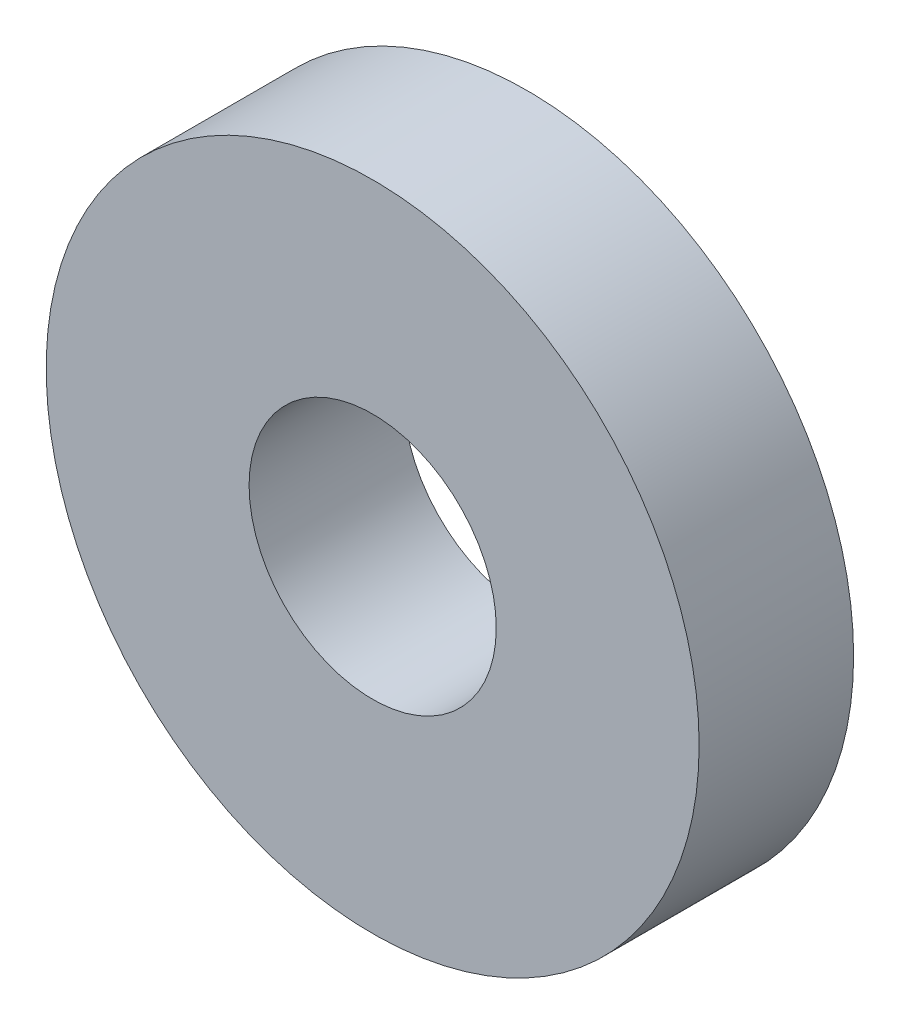
ISO-10303-21;
HEADER;
FILE_DESCRIPTION(('STEP AP214'),'2;1');
FILE_NAME('part.step','',(''),(''),'','','');
FILE_SCHEMA(('AUTOMOTIVE_DESIGN { 1 0 10303 214 1 1 1 1 }'));
ENDSEC;
DATA;
#1=APPLICATION_CONTEXT('core data for automotive mechanical design processes');
#2=APPLICATION_PROTOCOL_DEFINITION('international standard','automotive_design',2000,#1);
#3=PRODUCT_CONTEXT('',#1,'mechanical');
#4=PRODUCT('Part','Part','',(#3));
#5=PRODUCT_RELATED_PRODUCT_CATEGORY('part','',(#4));
#6=PRODUCT_DEFINITION_FORMATION('','',#4);
#7=PRODUCT_DEFINITION_CONTEXT('part definition',#1,'design');
#8=PRODUCT_DEFINITION('design','',#6,#7);
#9=PRODUCT_DEFINITION_SHAPE('','',#8);
#10=(LENGTH_UNIT() NAMED_UNIT(*) SI_UNIT(.MILLI.,.METRE.));
#11=(NAMED_UNIT(*) PLANE_ANGLE_UNIT() SI_UNIT($,.RADIAN.));
#12=(NAMED_UNIT(*) SI_UNIT($,.STERADIAN.) SOLID_ANGLE_UNIT());
#13=UNCERTAINTY_MEASURE_WITH_UNIT(LENGTH_MEASURE(1.E-05),#10,'distance_accuracy_value','');
#14=(GEOMETRIC_REPRESENTATION_CONTEXT(3) GLOBAL_UNCERTAINTY_ASSIGNED_CONTEXT((#13)) GLOBAL_UNIT_ASSIGNED_CONTEXT((#10,
#11,#12)) REPRESENTATION_CONTEXT('',''));
#15=CARTESIAN_POINT('',(0.,0.,0.));
#16=DIRECTION('',(0.,0.,1.));
#17=DIRECTION('',(1.,0.,0.));
#18=AXIS2_PLACEMENT_3D('',#15,#16,#17);
#19=CARTESIAN_POINT('',(0.,0.,75.));
#20=DIRECTION('',(0.,0.,1.));
#21=DIRECTION('',(1.,0.,0.));
#22=AXIS2_PLACEMENT_3D('',#19,#20,#21);
#23=PLANE('',#22);
#24=CARTESIAN_POINT('',(0.,0.,75.));
#25=DIRECTION('',(0.,0.,1.));
#26=DIRECTION('',(1.,0.,0.));
#27=AXIS2_PLACEMENT_3D('',#24,#25,#26);
#28=CIRCLE('',#27,158.5);
#29=CARTESIAN_POINT('',(158.5,0.,75.));
#30=VERTEX_POINT('',#29);
#31=EDGE_CURVE('E10',#30,#30,#28,.T.);
#32=ORIENTED_EDGE('',*,*,#31,.T.);
#33=EDGE_LOOP('',(#32));
#34=FACE_BOUND('',#33,.T.);
#35=CARTESIAN_POINT('',(0.,0.,75.));
#36=DIRECTION('',(0.,0.,1.));
#37=DIRECTION('',(1.,0.,0.));
#38=AXIS2_PLACEMENT_3D('',#35,#36,#37);
#39=CIRCLE('',#38,60.);
#40=CARTESIAN_POINT('',(60.,0.,75.));
#41=VERTEX_POINT('',#40);
#42=EDGE_CURVE('E50',#41,#41,#39,.T.);
#43=ORIENTED_EDGE('',*,*,#42,.F.);
#44=EDGE_LOOP('',(#43));
#45=FACE_BOUND('',#44,.T.);
#46=ADVANCED_FACE('F37',(#34,#45),#23,.T.);
#47=CARTESIAN_POINT('',(0.,0.,0.));
#48=DIRECTION('',(0.,0.,1.));
#49=DIRECTION('',(1.,0.,0.));
#50=AXIS2_PLACEMENT_3D('',#47,#48,#49);
#51=PLANE('',#50);
#52=CARTESIAN_POINT('',(0.,0.,0.));
#53=DIRECTION('',(0.,0.,1.));
#54=DIRECTION('',(1.,0.,0.));
#55=AXIS2_PLACEMENT_3D('',#52,#53,#54);
#56=CIRCLE('',#55,158.5);
#57=CARTESIAN_POINT('',(158.5,0.,0.));
#58=VERTEX_POINT('',#57);
#59=EDGE_CURVE('E41',#58,#58,#56,.T.);
#60=ORIENTED_EDGE('',*,*,#59,.F.);
#61=EDGE_LOOP('',(#60));
#62=FACE_BOUND('',#61,.T.);
#63=CARTESIAN_POINT('',(0.,0.,0.));
#64=DIRECTION('',(0.,0.,1.));
#65=DIRECTION('',(1.,0.,0.));
#66=AXIS2_PLACEMENT_3D('',#63,#64,#65);
#67=CIRCLE('',#66,60.);
#68=CARTESIAN_POINT('',(60.,0.,0.));
#69=VERTEX_POINT('',#68);
#70=EDGE_CURVE('E52',#69,#69,#67,.T.);
#71=ORIENTED_EDGE('',*,*,#70,.T.);
#72=EDGE_LOOP('',(#71));
#73=FACE_BOUND('',#72,.T.);
#74=ADVANCED_FACE('F64',(#62,#73),#51,.F.);
#75=CARTESIAN_POINT('',(0.,0.,75.));
#76=DIRECTION('',(0.,0.,-1.));
#77=DIRECTION('',(-1.,0.,0.));
#78=AXIS2_PLACEMENT_3D('',#75,#76,#77);
#79=CYLINDRICAL_SURFACE('',#78,158.5);
#80=ORIENTED_EDGE('',*,*,#31,.F.);
#81=EDGE_LOOP('',(#80));
#82=FACE_BOUND('',#81,.T.);
#83=ORIENTED_EDGE('',*,*,#59,.T.);
#84=EDGE_LOOP('',(#83));
#85=FACE_BOUND('',#84,.T.);
#86=ADVANCED_FACE('F39',(#82,#85),#79,.T.);
#87=CARTESIAN_POINT('',(0.,0.,75.));
#88=DIRECTION('',(0.,0.,-1.));
#89=DIRECTION('',(-1.,0.,0.));
#90=AXIS2_PLACEMENT_3D('',#87,#88,#89);
#91=CYLINDRICAL_SURFACE('',#90,60.);
#92=ORIENTED_EDGE('',*,*,#42,.T.);
#93=EDGE_LOOP('',(#92));
#94=FACE_BOUND('',#93,.T.);
#95=ORIENTED_EDGE('',*,*,#70,.F.);
#96=EDGE_LOOP('',(#95));
#97=FACE_BOUND('',#96,.T.);
#98=ADVANCED_FACE('F60',(#94,#97),#91,.F.);
#99=CLOSED_SHELL('',(#46,#74,#86,#98));
#100=MANIFOLD_SOLID_BREP('B2',#99);
#101=ADVANCED_BREP_SHAPE_REPRESENTATION('',(#18,#100),#14);
#102=SHAPE_DEFINITION_REPRESENTATION(#9,#101);
ENDSEC;
END-ISO-10303-21;
